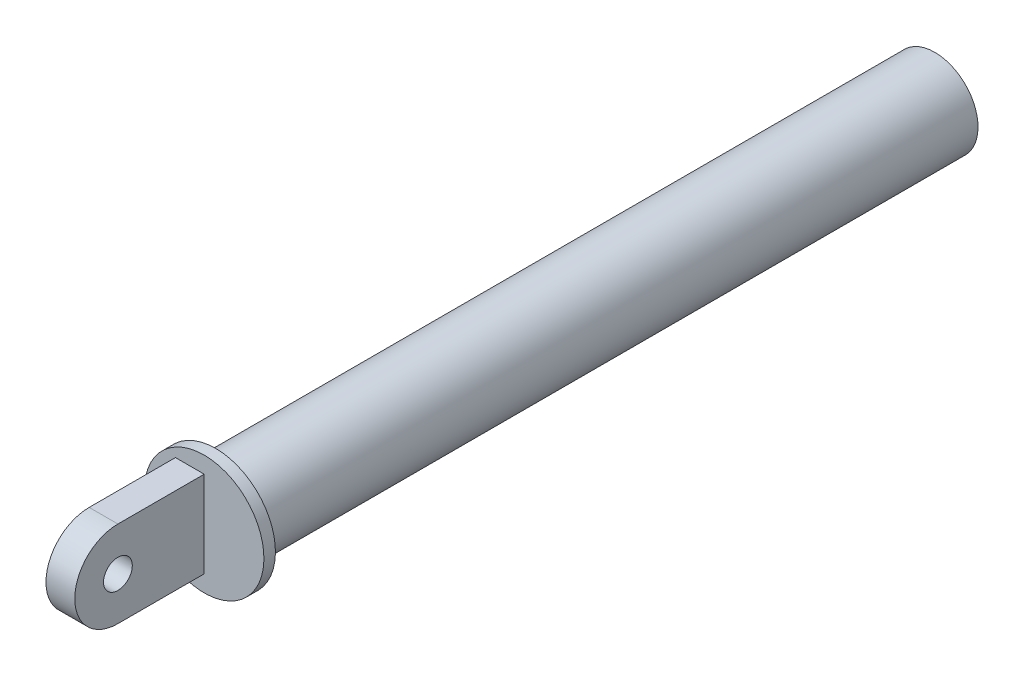
ISO-10303-21;
HEADER;
FILE_DESCRIPTION(('STEP AP214'),'2;1');
FILE_NAME('part.step','',(''),(''),'','','');
FILE_SCHEMA(('AUTOMOTIVE_DESIGN { 1 0 10303 214 1 1 1 1 }'));
ENDSEC;
DATA;
#1=APPLICATION_CONTEXT('core data for automotive mechanical design processes');
#2=APPLICATION_PROTOCOL_DEFINITION('international standard','automotive_design',2000,#1);
#3=PRODUCT_CONTEXT('',#1,'mechanical');
#4=PRODUCT('Part','Part','',(#3));
#5=PRODUCT_RELATED_PRODUCT_CATEGORY('part','',(#4));
#6=PRODUCT_DEFINITION_FORMATION('','',#4);
#7=PRODUCT_DEFINITION_CONTEXT('part definition',#1,'design');
#8=PRODUCT_DEFINITION('design','',#6,#7);
#9=PRODUCT_DEFINITION_SHAPE('','',#8);
#10=(LENGTH_UNIT() NAMED_UNIT(*) SI_UNIT(.MILLI.,.METRE.));
#11=(NAMED_UNIT(*) PLANE_ANGLE_UNIT() SI_UNIT($,.RADIAN.));
#12=(NAMED_UNIT(*) SI_UNIT($,.STERADIAN.) SOLID_ANGLE_UNIT());
#13=UNCERTAINTY_MEASURE_WITH_UNIT(LENGTH_MEASURE(1.E-05),#10,'distance_accuracy_value','');
#14=(GEOMETRIC_REPRESENTATION_CONTEXT(3) GLOBAL_UNCERTAINTY_ASSIGNED_CONTEXT((#13)) GLOBAL_UNIT_ASSIGNED_CONTEXT((#10,
#11,#12)) REPRESENTATION_CONTEXT('',''));
#15=CARTESIAN_POINT('',(0.,0.,0.));
#16=DIRECTION('',(0.,0.,1.));
#17=DIRECTION('',(1.,0.,0.));
#18=AXIS2_PLACEMENT_3D('',#15,#16,#17);
#19=CARTESIAN_POINT('',(5.,0.,0.));
#20=DIRECTION('',(1.,0.,0.));
#21=DIRECTION('',(0.,0.,-1.));
#22=AXIS2_PLACEMENT_3D('',#19,#20,#21);
#23=PLANE('',#22);
#24=CARTESIAN_POINT('',(5.,0.,0.));
#25=DIRECTION('',(1.,0.,0.));
#26=DIRECTION('',(0.,0.,-1.));
#27=AXIS2_PLACEMENT_3D('',#24,#25,#26);
#28=CIRCLE('',#27,15.);
#29=CARTESIAN_POINT('',(5.,15.,0.));
#30=VERTEX_POINT('',#29);
#31=CARTESIAN_POINT('',(5.,-15.,0.));
#32=VERTEX_POINT('',#31);
#33=EDGE_CURVE('E119',#30,#32,#28,.T.);
#34=ORIENTED_EDGE('',*,*,#33,.T.);
#35=DIRECTION('',(0.,0.,-1.));
#36=VECTOR('',#35,1.);
#37=CARTESIAN_POINT('',(5.,-15.,0.));
#38=LINE('',#37,#36);
#39=CARTESIAN_POINT('',(5.,-15.,-30.));
#40=VERTEX_POINT('',#39);
#41=EDGE_CURVE('E86',#32,#40,#38,.T.);
#42=ORIENTED_EDGE('',*,*,#41,.T.);
#43=DIRECTION('',(0.,1.,0.));
#44=VECTOR('',#43,1.);
#45=CARTESIAN_POINT('',(5.,15.,-30.));
#46=LINE('',#45,#44);
#47=CARTESIAN_POINT('',(5.,15.,-30.));
#48=VERTEX_POINT('',#47);
#49=EDGE_CURVE('E110',#40,#48,#46,.T.);
#50=ORIENTED_EDGE('',*,*,#49,.T.);
#51=DIRECTION('',(0.,0.,1.));
#52=VECTOR('',#51,1.);
#53=CARTESIAN_POINT('',(5.,15.,0.));
#54=LINE('',#53,#52);
#55=EDGE_CURVE('E62',#48,#30,#54,.T.);
#56=ORIENTED_EDGE('',*,*,#55,.T.);
#57=EDGE_LOOP('',(#34,#42,#50,#56));
#58=FACE_BOUND('',#57,.T.);
#59=CARTESIAN_POINT('',(5.,0.,0.));
#60=DIRECTION('',(1.,0.,0.));
#61=DIRECTION('',(0.,0.,-1.));
#62=AXIS2_PLACEMENT_3D('',#59,#60,#61);
#63=CIRCLE('',#62,5.);
#64=CARTESIAN_POINT('',(5.,0.,-5.));
#65=VERTEX_POINT('',#64);
#66=EDGE_CURVE('E123',#65,#65,#63,.T.);
#67=ORIENTED_EDGE('',*,*,#66,.F.);
#68=EDGE_LOOP('',(#67));
#69=FACE_BOUND('',#68,.T.);
#70=ADVANCED_FACE('F44',(#58,#69),#23,.T.);
#71=CARTESIAN_POINT('',(-5.,0.,0.));
#72=DIRECTION('',(1.,0.,0.));
#73=DIRECTION('',(0.,0.,-1.));
#74=AXIS2_PLACEMENT_3D('',#71,#72,#73);
#75=PLANE('',#74);
#76=CARTESIAN_POINT('',(-5.,0.,0.));
#77=DIRECTION('',(1.,0.,0.));
#78=DIRECTION('',(0.,0.,-1.));
#79=AXIS2_PLACEMENT_3D('',#76,#77,#78);
#80=CIRCLE('',#79,15.);
#81=CARTESIAN_POINT('',(-5.,15.,0.));
#82=VERTEX_POINT('',#81);
#83=CARTESIAN_POINT('',(-5.,-15.,0.));
#84=VERTEX_POINT('',#83);
#85=EDGE_CURVE('E106',#82,#84,#80,.T.);
#86=ORIENTED_EDGE('',*,*,#85,.F.);
#87=DIRECTION('',(0.,0.,1.));
#88=VECTOR('',#87,1.);
#89=CARTESIAN_POINT('',(-5.,15.,0.));
#90=LINE('',#89,#88);
#91=CARTESIAN_POINT('',(-5.,15.,-30.));
#92=VERTEX_POINT('',#91);
#93=EDGE_CURVE('E79',#92,#82,#90,.T.);
#94=ORIENTED_EDGE('',*,*,#93,.F.);
#95=DIRECTION('',(0.,1.,0.));
#96=VECTOR('',#95,1.);
#97=CARTESIAN_POINT('',(-5.,15.,-30.));
#98=LINE('',#97,#96);
#99=CARTESIAN_POINT('',(-5.,-15.,-30.));
#100=VERTEX_POINT('',#99);
#101=EDGE_CURVE('E91',#100,#92,#98,.T.);
#102=ORIENTED_EDGE('',*,*,#101,.F.);
#103=DIRECTION('',(0.,0.,-1.));
#104=VECTOR('',#103,1.);
#105=CARTESIAN_POINT('',(-5.,-15.,0.));
#106=LINE('',#105,#104);
#107=EDGE_CURVE('E96',#84,#100,#106,.T.);
#108=ORIENTED_EDGE('',*,*,#107,.F.);
#109=EDGE_LOOP('',(#86,#94,#102,#108));
#110=FACE_BOUND('',#109,.T.);
#111=CARTESIAN_POINT('',(-5.,0.,0.));
#112=DIRECTION('',(1.,0.,0.));
#113=DIRECTION('',(0.,0.,-1.));
#114=AXIS2_PLACEMENT_3D('',#111,#112,#113);
#115=CIRCLE('',#114,5.);
#116=CARTESIAN_POINT('',(-5.,0.,-5.));
#117=VERTEX_POINT('',#116);
#118=EDGE_CURVE('E132',#117,#117,#115,.T.);
#119=ORIENTED_EDGE('',*,*,#118,.T.);
#120=EDGE_LOOP('',(#119));
#121=FACE_BOUND('',#120,.T.);
#122=ADVANCED_FACE('F94',(#110,#121),#75,.F.);
#123=CARTESIAN_POINT('',(5.,0.,0.));
#124=DIRECTION('',(-1.,0.,0.));
#125=DIRECTION('',(0.,0.,1.));
#126=AXIS2_PLACEMENT_3D('',#123,#124,#125);
#127=CYLINDRICAL_SURFACE('',#126,15.);
#128=ORIENTED_EDGE('',*,*,#85,.T.);
#129=DIRECTION('',(-1.,0.,0.));
#130=VECTOR('',#129,1.);
#131=CARTESIAN_POINT('',(5.,-15.,0.));
#132=LINE('',#131,#130);
#133=EDGE_CURVE('E11',#32,#84,#132,.T.);
#134=ORIENTED_EDGE('',*,*,#133,.F.);
#135=ORIENTED_EDGE('',*,*,#33,.F.);
#136=DIRECTION('',(-1.,0.,0.));
#137=VECTOR('',#136,1.);
#138=CARTESIAN_POINT('',(5.,15.,0.));
#139=LINE('',#138,#137);
#140=EDGE_CURVE('E113',#30,#82,#139,.T.);
#141=ORIENTED_EDGE('',*,*,#140,.T.);
#142=EDGE_LOOP('',(#128,#134,#135,#141));
#143=FACE_BOUND('',#142,.T.);
#144=ADVANCED_FACE('F46',(#143),#127,.T.);
#145=CARTESIAN_POINT('',(5.,-15.,0.));
#146=DIRECTION('',(0.,1.,0.));
#147=DIRECTION('',(0.,0.,1.));
#148=AXIS2_PLACEMENT_3D('',#145,#146,#147);
#149=PLANE('',#148);
#150=ORIENTED_EDGE('',*,*,#107,.T.);
#151=DIRECTION('',(-1.,0.,0.));
#152=VECTOR('',#151,1.);
#153=CARTESIAN_POINT('',(5.,-15.,-30.));
#154=LINE('',#153,#152);
#155=EDGE_CURVE('E54',#40,#100,#154,.T.);
#156=ORIENTED_EDGE('',*,*,#155,.F.);
#157=ORIENTED_EDGE('',*,*,#41,.F.);
#158=ORIENTED_EDGE('',*,*,#133,.T.);
#159=EDGE_LOOP('',(#150,#156,#157,#158));
#160=FACE_BOUND('',#159,.T.);
#161=ADVANCED_FACE('F101',(#160),#149,.F.);
#162=CARTESIAN_POINT('',(5.,15.,0.));
#163=DIRECTION('',(0.,-1.,0.));
#164=DIRECTION('',(0.,0.,-1.));
#165=AXIS2_PLACEMENT_3D('',#162,#163,#164);
#166=PLANE('',#165);
#167=ORIENTED_EDGE('',*,*,#93,.T.);
#168=ORIENTED_EDGE('',*,*,#140,.F.);
#169=ORIENTED_EDGE('',*,*,#55,.F.);
#170=DIRECTION('',(-1.,0.,0.));
#171=VECTOR('',#170,1.);
#172=CARTESIAN_POINT('',(5.,15.,-30.));
#173=LINE('',#172,#171);
#174=EDGE_CURVE('E76',#48,#92,#173,.T.);
#175=ORIENTED_EDGE('',*,*,#174,.T.);
#176=EDGE_LOOP('',(#167,#168,#169,#175));
#177=FACE_BOUND('',#176,.T.);
#178=ADVANCED_FACE('F182',(#177),#166,.F.);
#179=CARTESIAN_POINT('',(5.,0.,0.));
#180=DIRECTION('',(-1.,0.,0.));
#181=DIRECTION('',(0.,0.,1.));
#182=AXIS2_PLACEMENT_3D('',#179,#180,#181);
#183=CYLINDRICAL_SURFACE('',#182,5.);
#184=ORIENTED_EDGE('',*,*,#66,.T.);
#185=EDGE_LOOP('',(#184));
#186=FACE_BOUND('',#185,.T.);
#187=ORIENTED_EDGE('',*,*,#118,.F.);
#188=EDGE_LOOP('',(#187));
#189=FACE_BOUND('',#188,.T.);
#190=ADVANCED_FACE('F179',(#186,#189),#183,.F.);
#191=CARTESIAN_POINT('',(5.,15.,-30.));
#192=DIRECTION('',(0.,0.,1.));
#193=DIRECTION('',(0.,-1.,0.));
#194=AXIS2_PLACEMENT_3D('',#191,#192,#193);
#195=PLANE('',#194);
#196=ORIENTED_EDGE('',*,*,#155,.T.);
#197=ORIENTED_EDGE('',*,*,#101,.T.);
#198=ORIENTED_EDGE('',*,*,#174,.F.);
#199=ORIENTED_EDGE('',*,*,#49,.F.);
#200=EDGE_LOOP('',(#196,#197,#198,#199));
#201=FACE_BOUND('',#200,.T.);
#202=CARTESIAN_POINT('',(5.,0.,-30.));
#203=DIRECTION('',(0.,0.,-1.));
#204=DIRECTION('',(0.,1.,0.));
#205=AXIS2_PLACEMENT_3D('',#202,#203,#204);
#206=CIRCLE('',#205,20.7537586818231);
#207=CARTESIAN_POINT('',(5.,20.7537586818231,-30.));
#208=VERTEX_POINT('',#207);
#209=EDGE_CURVE('E136',#208,#208,#206,.T.);
#210=ORIENTED_EDGE('',*,*,#209,.F.);
#211=EDGE_LOOP('',(#210));
#212=FACE_BOUND('',#211,.T.);
#213=ADVANCED_FACE('F108',(#201,#212),#195,.T.);
#214=CARTESIAN_POINT('',(5.,0.,-283.999504277547));
#215=DIRECTION('',(0.,0.,-1.));
#216=DIRECTION('',(0.,1.,0.));
#217=AXIS2_PLACEMENT_3D('',#214,#215,#216);
#218=CYLINDRICAL_SURFACE('',#217,20.7537586818231);
#219=ORIENTED_EDGE('',*,*,#209,.T.);
#220=EDGE_LOOP('',(#219));
#221=FACE_BOUND('',#220,.T.);
#222=CARTESIAN_POINT('',(5.,0.,-33.9995042775471));
#223=DIRECTION('',(0.,0.,-1.));
#224=DIRECTION('',(0.,1.,0.));
#225=AXIS2_PLACEMENT_3D('',#222,#223,#224);
#226=CIRCLE('',#225,20.7537586818231);
#227=CARTESIAN_POINT('',(5.,20.7537586818231,-33.9995042775471));
#228=VERTEX_POINT('',#227);
#229=EDGE_CURVE('E143',#228,#228,#226,.T.);
#230=ORIENTED_EDGE('',*,*,#229,.F.);
#231=EDGE_LOOP('',(#230));
#232=FACE_BOUND('',#231,.T.);
#233=ADVANCED_FACE('F168',(#221,#232),#218,.T.);
#234=CARTESIAN_POINT('',(5.,20.7537586818231,-33.9995042775471));
#235=DIRECTION('',(0.,0.,-1.));
#236=DIRECTION('',(0.,1.,0.));
#237=AXIS2_PLACEMENT_3D('',#234,#235,#236);
#238=PLANE('',#237);
#239=ORIENTED_EDGE('',*,*,#229,.T.);
#240=EDGE_LOOP('',(#239));
#241=FACE_BOUND('',#240,.T.);
#242=CARTESIAN_POINT('',(5.,0.,-33.9995042775471));
#243=DIRECTION('',(0.,0.,-1.));
#244=DIRECTION('',(0.,1.,0.));
#245=AXIS2_PLACEMENT_3D('',#242,#243,#244);
#246=CIRCLE('',#245,15.);
#247=CARTESIAN_POINT('',(5.,15.,-33.9995042775471));
#248=VERTEX_POINT('',#247);
#249=EDGE_CURVE('E147',#248,#248,#246,.T.);
#250=ORIENTED_EDGE('',*,*,#249,.F.);
#251=EDGE_LOOP('',(#250));
#252=FACE_BOUND('',#251,.T.);
#253=ADVANCED_FACE('F160',(#241,#252),#238,.T.);
#254=CARTESIAN_POINT('',(5.,0.,-283.999504277547));
#255=DIRECTION('',(0.,0.,-1.));
#256=DIRECTION('',(0.,1.,0.));
#257=AXIS2_PLACEMENT_3D('',#254,#255,#256);
#258=CYLINDRICAL_SURFACE('',#257,15.);
#259=ORIENTED_EDGE('',*,*,#249,.T.);
#260=EDGE_LOOP('',(#259));
#261=FACE_BOUND('',#260,.T.);
#262=CARTESIAN_POINT('',(5.,0.,-283.999504277547));
#263=DIRECTION('',(0.,0.,-1.));
#264=DIRECTION('',(0.,1.,0.));
#265=AXIS2_PLACEMENT_3D('',#262,#263,#264);
#266=CIRCLE('',#265,15.);
#267=CARTESIAN_POINT('',(5.,15.,-283.999504277547));
#268=VERTEX_POINT('',#267);
#269=EDGE_CURVE('E151',#268,#268,#266,.T.);
#270=ORIENTED_EDGE('',*,*,#269,.F.);
#271=EDGE_LOOP('',(#270));
#272=FACE_BOUND('',#271,.T.);
#273=ADVANCED_FACE('F158',(#261,#272),#258,.T.);
#274=CARTESIAN_POINT('',(5.,15.,-283.999504277547));
#275=DIRECTION('',(0.,0.,-1.));
#276=DIRECTION('',(0.,1.,0.));
#277=AXIS2_PLACEMENT_3D('',#274,#275,#276);
#278=PLANE('',#277);
#279=ORIENTED_EDGE('',*,*,#269,.T.);
#280=EDGE_LOOP('',(#279));
#281=FACE_BOUND('',#280,.T.);
#282=ADVANCED_FACE('F156',(#281),#278,.T.);
#283=CLOSED_SHELL('',(#70,#122,#144,#161,#178,#190,#213,#233,#253,#273,#282));
#284=MANIFOLD_SOLID_BREP('B2',#283);
#285=ADVANCED_BREP_SHAPE_REPRESENTATION('',(#18,#284),#14);
#286=SHAPE_DEFINITION_REPRESENTATION(#9,#285);
ENDSEC;
END-ISO-10303-21;
